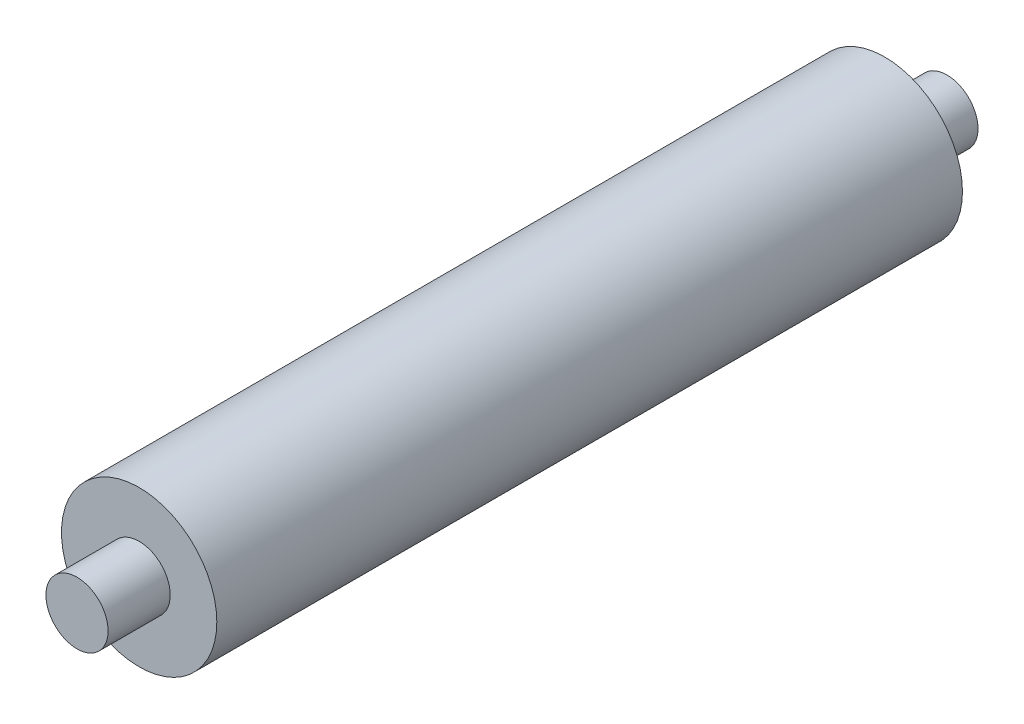
ISO-10303-21;
HEADER;
FILE_DESCRIPTION(('STEP AP214'),'2;1');
FILE_NAME('part.step','',(''),(''),'','','');
FILE_SCHEMA(('AUTOMOTIVE_DESIGN { 1 0 10303 214 1 1 1 1 }'));
ENDSEC;
DATA;
#1=APPLICATION_CONTEXT('core data for automotive mechanical design processes');
#2=APPLICATION_PROTOCOL_DEFINITION('international standard','automotive_design',2000,#1);
#3=PRODUCT_CONTEXT('',#1,'mechanical');
#4=PRODUCT('Part','Part','',(#3));
#5=PRODUCT_RELATED_PRODUCT_CATEGORY('part','',(#4));
#6=PRODUCT_DEFINITION_FORMATION('','',#4);
#7=PRODUCT_DEFINITION_CONTEXT('part definition',#1,'design');
#8=PRODUCT_DEFINITION('design','',#6,#7);
#9=PRODUCT_DEFINITION_SHAPE('','',#8);
#10=(LENGTH_UNIT() NAMED_UNIT(*) SI_UNIT(.MILLI.,.METRE.));
#11=(NAMED_UNIT(*) PLANE_ANGLE_UNIT() SI_UNIT($,.RADIAN.));
#12=(NAMED_UNIT(*) SI_UNIT($,.STERADIAN.) SOLID_ANGLE_UNIT());
#13=UNCERTAINTY_MEASURE_WITH_UNIT(LENGTH_MEASURE(1.E-05),#10,'distance_accuracy_value','');
#14=(GEOMETRIC_REPRESENTATION_CONTEXT(3) GLOBAL_UNCERTAINTY_ASSIGNED_CONTEXT((#13)) GLOBAL_UNIT_ASSIGNED_CONTEXT((#10,
#11,#12)) REPRESENTATION_CONTEXT('',''));
#15=CARTESIAN_POINT('',(0.,0.,0.));
#16=DIRECTION('',(0.,0.,1.));
#17=DIRECTION('',(1.,0.,0.));
#18=AXIS2_PLACEMENT_3D('',#15,#16,#17);
#19=CARTESIAN_POINT('',(0.,0.,-120.));
#20=DIRECTION('',(0.,0.,1.));
#21=DIRECTION('',(1.,0.,0.));
#22=AXIS2_PLACEMENT_3D('',#19,#20,#21);
#23=CYLINDRICAL_SURFACE('',#22,12.5);
#24=CARTESIAN_POINT('',(0.,0.,-120.));
#25=DIRECTION('',(0.,0.,1.));
#26=DIRECTION('',(1.,0.,0.));
#27=AXIS2_PLACEMENT_3D('',#24,#25,#26);
#28=CIRCLE('',#27,12.5);
#29=CARTESIAN_POINT('',(12.5,0.,-120.));
#30=VERTEX_POINT('',#29);
#31=EDGE_CURVE('E45',#30,#30,#28,.T.);
#32=ORIENTED_EDGE('',*,*,#31,.T.);
#33=EDGE_LOOP('',(#32));
#34=FACE_BOUND('',#33,.T.);
#35=CARTESIAN_POINT('',(0.,0.,0.));
#36=DIRECTION('',(0.,0.,1.));
#37=DIRECTION('',(1.,0.,0.));
#38=AXIS2_PLACEMENT_3D('',#35,#36,#37);
#39=CIRCLE('',#38,12.5);
#40=CARTESIAN_POINT('',(12.5,0.,0.));
#41=VERTEX_POINT('',#40);
#42=EDGE_CURVE('E40',#41,#41,#39,.T.);
#43=ORIENTED_EDGE('',*,*,#42,.F.);
#44=EDGE_LOOP('',(#43));
#45=FACE_BOUND('',#44,.T.);
#46=ADVANCED_FACE('F37',(#34,#45),#23,.T.);
#47=CARTESIAN_POINT('',(0.,0.,-120.));
#48=DIRECTION('',(0.,0.,1.));
#49=DIRECTION('',(1.,0.,0.));
#50=AXIS2_PLACEMENT_3D('',#47,#48,#49);
#51=PLANE('',#50);
#52=CARTESIAN_POINT('',(0.,0.,-120.));
#53=DIRECTION('',(0.,0.,1.));
#54=DIRECTION('',(1.,0.,0.));
#55=AXIS2_PLACEMENT_3D('',#52,#53,#54);
#56=CIRCLE('',#55,5.);
#57=CARTESIAN_POINT('',(5.,0.,-120.));
#58=VERTEX_POINT('',#57);
#59=EDGE_CURVE('E57',#58,#58,#56,.T.);
#60=ORIENTED_EDGE('',*,*,#59,.T.);
#61=EDGE_LOOP('',(#60));
#62=FACE_BOUND('',#61,.T.);
#63=ORIENTED_EDGE('',*,*,#31,.F.);
#64=EDGE_LOOP('',(#63));
#65=FACE_BOUND('',#64,.T.);
#66=ADVANCED_FACE('F77',(#62,#65),#51,.F.);
#67=CARTESIAN_POINT('',(0.,0.,0.));
#68=DIRECTION('',(0.,0.,1.));
#69=DIRECTION('',(1.,0.,0.));
#70=AXIS2_PLACEMENT_3D('',#67,#68,#69);
#71=PLANE('',#70);
#72=CARTESIAN_POINT('',(0.,0.,0.));
#73=DIRECTION('',(0.,0.,1.));
#74=DIRECTION('',(1.,0.,0.));
#75=AXIS2_PLACEMENT_3D('',#72,#73,#74);
#76=CIRCLE('',#75,5.);
#77=CARTESIAN_POINT('',(5.,0.,0.));
#78=VERTEX_POINT('',#77);
#79=EDGE_CURVE('E10',#78,#78,#76,.T.);
#80=ORIENTED_EDGE('',*,*,#79,.F.);
#81=EDGE_LOOP('',(#80));
#82=FACE_BOUND('',#81,.T.);
#83=ORIENTED_EDGE('',*,*,#42,.T.);
#84=EDGE_LOOP('',(#83));
#85=FACE_BOUND('',#84,.T.);
#86=ADVANCED_FACE('F82',(#82,#85),#71,.T.);
#87=CARTESIAN_POINT('',(0.,0.,10.));
#88=DIRECTION('',(0.,0.,-1.));
#89=DIRECTION('',(-1.,0.,0.));
#90=AXIS2_PLACEMENT_3D('',#87,#88,#89);
#91=CYLINDRICAL_SURFACE('',#90,5.);
#92=CARTESIAN_POINT('',(0.,0.,10.));
#93=DIRECTION('',(0.,0.,1.));
#94=DIRECTION('',(1.,0.,0.));
#95=AXIS2_PLACEMENT_3D('',#92,#93,#94);
#96=CIRCLE('',#95,5.);
#97=CARTESIAN_POINT('',(5.,0.,10.));
#98=VERTEX_POINT('',#97);
#99=EDGE_CURVE('E52',#98,#98,#96,.T.);
#100=ORIENTED_EDGE('',*,*,#99,.F.);
#101=EDGE_LOOP('',(#100));
#102=FACE_BOUND('',#101,.T.);
#103=ORIENTED_EDGE('',*,*,#79,.T.);
#104=EDGE_LOOP('',(#103));
#105=FACE_BOUND('',#104,.T.);
#106=ADVANCED_FACE('F92',(#102,#105),#91,.T.);
#107=CARTESIAN_POINT('',(0.,0.,10.));
#108=DIRECTION('',(0.,0.,1.));
#109=DIRECTION('',(1.,0.,0.));
#110=AXIS2_PLACEMENT_3D('',#107,#108,#109);
#111=PLANE('',#110);
#112=ORIENTED_EDGE('',*,*,#99,.T.);
#113=EDGE_LOOP('',(#112));
#114=FACE_BOUND('',#113,.T.);
#115=ADVANCED_FACE('F74',(#114),#111,.T.);
#116=CARTESIAN_POINT('',(0.,0.,-130.));
#117=DIRECTION('',(0.,0.,1.));
#118=DIRECTION('',(1.,0.,0.));
#119=AXIS2_PLACEMENT_3D('',#116,#117,#118);
#120=CYLINDRICAL_SURFACE('',#119,5.);
#121=CARTESIAN_POINT('',(0.,0.,-130.));
#122=DIRECTION('',(0.,0.,1.));
#123=DIRECTION('',(1.,0.,0.));
#124=AXIS2_PLACEMENT_3D('',#121,#122,#123);
#125=CIRCLE('',#124,5.);
#126=CARTESIAN_POINT('',(5.,0.,-130.));
#127=VERTEX_POINT('',#126);
#128=EDGE_CURVE('E56',#127,#127,#125,.T.);
#129=ORIENTED_EDGE('',*,*,#128,.T.);
#130=EDGE_LOOP('',(#129));
#131=FACE_BOUND('',#130,.T.);
#132=ORIENTED_EDGE('',*,*,#59,.F.);
#133=EDGE_LOOP('',(#132));
#134=FACE_BOUND('',#133,.T.);
#135=ADVANCED_FACE('F65',(#131,#134),#120,.T.);
#136=CARTESIAN_POINT('',(0.,0.,-130.));
#137=DIRECTION('',(0.,0.,-1.));
#138=DIRECTION('',(1.,0.,0.));
#139=AXIS2_PLACEMENT_3D('',#136,#137,#138);
#140=PLANE('',#139);
#141=ORIENTED_EDGE('',*,*,#128,.F.);
#142=EDGE_LOOP('',(#141));
#143=FACE_BOUND('',#142,.T.);
#144=ADVANCED_FACE('F68',(#143),#140,.T.);
#145=CLOSED_SHELL('',(#46,#66,#86,#106,#115,#135,#144));
#146=MANIFOLD_SOLID_BREP('B2',#145);
#147=ADVANCED_BREP_SHAPE_REPRESENTATION('',(#18,#146),#14);
#148=SHAPE_DEFINITION_REPRESENTATION(#9,#147);
ENDSEC;
END-ISO-10303-21;
